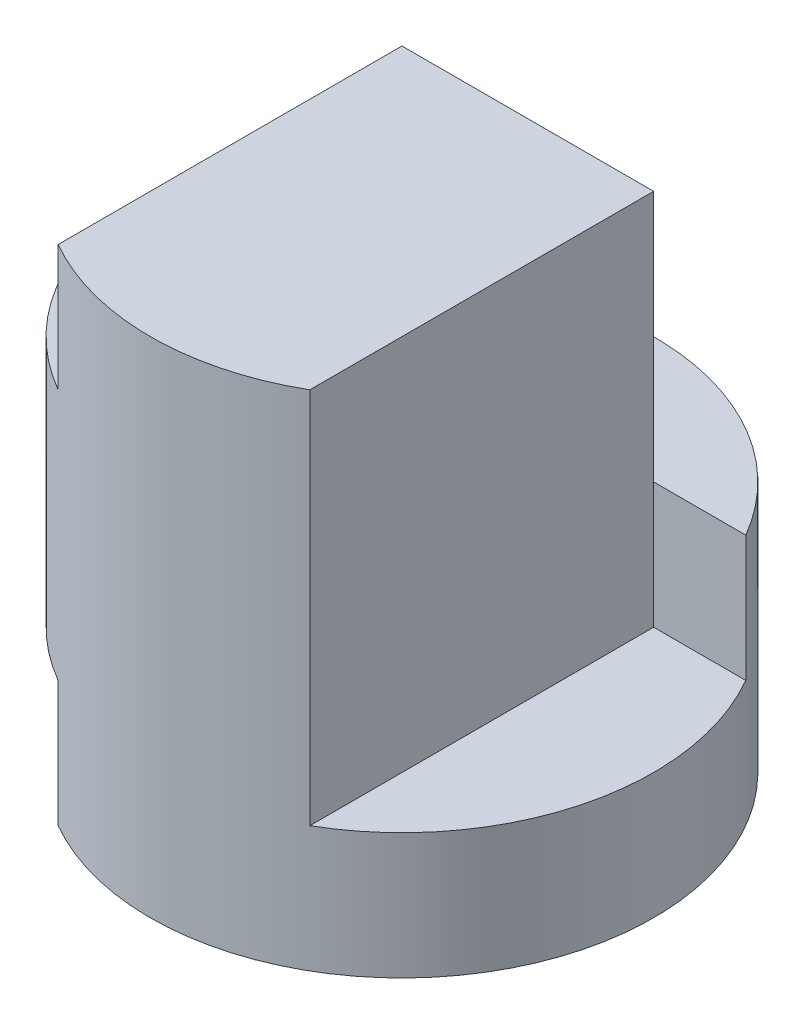
ISO-10303-21;
HEADER;
FILE_DESCRIPTION(('STEP AP214'),'2;1');
FILE_NAME('part.step','',(''),(''),'','','');
FILE_SCHEMA(('AUTOMOTIVE_DESIGN { 1 0 10303 214 1 1 1 1 }'));
ENDSEC;
DATA;
#1=APPLICATION_CONTEXT('core data for automotive mechanical design processes');
#2=APPLICATION_PROTOCOL_DEFINITION('international standard','automotive_design',2000,#1);
#3=PRODUCT_CONTEXT('',#1,'mechanical');
#4=PRODUCT('Part','Part','',(#3));
#5=PRODUCT_RELATED_PRODUCT_CATEGORY('part','',(#4));
#6=PRODUCT_DEFINITION_FORMATION('','',#4);
#7=PRODUCT_DEFINITION_CONTEXT('part definition',#1,'design');
#8=PRODUCT_DEFINITION('design','',#6,#7);
#9=PRODUCT_DEFINITION_SHAPE('','',#8);
#10=(LENGTH_UNIT() NAMED_UNIT(*) SI_UNIT(.MILLI.,.METRE.));
#11=(NAMED_UNIT(*) PLANE_ANGLE_UNIT() SI_UNIT($,.RADIAN.));
#12=(NAMED_UNIT(*) SI_UNIT($,.STERADIAN.) SOLID_ANGLE_UNIT());
#13=UNCERTAINTY_MEASURE_WITH_UNIT(LENGTH_MEASURE(1.E-05),#10,'distance_accuracy_value','');
#14=(GEOMETRIC_REPRESENTATION_CONTEXT(3) GLOBAL_UNCERTAINTY_ASSIGNED_CONTEXT((#13)) GLOBAL_UNIT_ASSIGNED_CONTEXT((#10,
#11,#12)) REPRESENTATION_CONTEXT('',''));
#15=CARTESIAN_POINT('',(0.,0.,0.));
#16=DIRECTION('',(0.,0.,1.));
#17=DIRECTION('',(1.,0.,0.));
#18=AXIS2_PLACEMENT_3D('',#15,#16,#17);
#19=CARTESIAN_POINT('',(0.,4.,0.));
#20=DIRECTION('',(0.,-1.,0.));
#21=DIRECTION('',(0.,0.,-1.));
#22=AXIS2_PLACEMENT_3D('',#19,#20,#21);
#23=CYLINDRICAL_SURFACE('',#22,2.);
#24=CARTESIAN_POINT('',(0.,3.,0.));
#25=DIRECTION('',(0.,1.,0.));
#26=DIRECTION('',(0.,0.,1.));
#27=AXIS2_PLACEMENT_3D('',#24,#25,#26);
#28=CIRCLE('',#27,2.);
#29=CARTESIAN_POINT('',(-1.73205080756888,3.,-1.));
#30=VERTEX_POINT('',#29);
#31=CARTESIAN_POINT('',(-1.,3.,1.73205080756888));
#32=VERTEX_POINT('',#31);
#33=EDGE_CURVE('E122',#30,#32,#28,.T.);
#34=ORIENTED_EDGE('',*,*,#33,.F.);
#35=DIRECTION('',(0.,1.,0.));
#36=VECTOR('',#35,1.);
#37=CARTESIAN_POINT('',(-1.73205080756888,2.,-1.));
#38=LINE('',#37,#36);
#39=CARTESIAN_POINT('',(-1.73205080756888,2.,-1.));
#40=VERTEX_POINT('',#39);
#41=EDGE_CURVE('E114',#40,#30,#38,.T.);
#42=ORIENTED_EDGE('',*,*,#41,.F.);
#43=CARTESIAN_POINT('',(0.,2.,0.));
#44=DIRECTION('',(0.,1.,0.));
#45=DIRECTION('',(0.,0.,-1.));
#46=AXIS2_PLACEMENT_3D('',#43,#44,#45);
#47=CIRCLE('',#46,2.);
#48=CARTESIAN_POINT('',(1.73205080756888,2.,-1.));
#49=VERTEX_POINT('',#48);
#50=EDGE_CURVE('E105',#49,#40,#47,.T.);
#51=ORIENTED_EDGE('',*,*,#50,.F.);
#52=DIRECTION('',(0.,-1.,0.));
#53=VECTOR('',#52,1.);
#54=CARTESIAN_POINT('',(1.73205080756888,4.,-1.));
#55=LINE('',#54,#53);
#56=CARTESIAN_POINT('',(1.73205080756888,1.,-1.));
#57=VERTEX_POINT('',#56);
#58=EDGE_CURVE('E154',#49,#57,#55,.T.);
#59=ORIENTED_EDGE('',*,*,#58,.T.);
#60=CARTESIAN_POINT('',(0.,1.,0.));
#61=DIRECTION('',(0.,1.,0.));
#62=DIRECTION('',(-1.,0.,0.));
#63=AXIS2_PLACEMENT_3D('',#60,#61,#62);
#64=CIRCLE('',#63,2.);
#65=CARTESIAN_POINT('',(1.,1.,1.73205080756888));
#66=VERTEX_POINT('',#65);
#67=EDGE_CURVE('E176',#66,#57,#64,.T.);
#68=ORIENTED_EDGE('',*,*,#67,.F.);
#69=DIRECTION('',(0.,-1.,0.));
#70=VECTOR('',#69,1.);
#71=CARTESIAN_POINT('',(1.,4.,1.73205080756888));
#72=LINE('',#71,#70);
#73=CARTESIAN_POINT('',(1.,4.,1.73205080756888));
#74=VERTEX_POINT('',#73);
#75=EDGE_CURVE('E156',#74,#66,#72,.T.);
#76=ORIENTED_EDGE('',*,*,#75,.F.);
#77=CARTESIAN_POINT('',(0.,4.,0.));
#78=DIRECTION('',(0.,1.,0.));
#79=DIRECTION('',(0.,0.,1.));
#80=AXIS2_PLACEMENT_3D('',#77,#78,#79);
#81=CIRCLE('',#80,2.);
#82=CARTESIAN_POINT('',(-1.,4.,1.73205080756888));
#83=VERTEX_POINT('',#82);
#84=EDGE_CURVE('E160',#83,#74,#81,.T.);
#85=ORIENTED_EDGE('',*,*,#84,.F.);
#86=DIRECTION('',(0.,-1.,0.));
#87=VECTOR('',#86,1.);
#88=CARTESIAN_POINT('',(-1.,4.,1.73205080756888));
#89=LINE('',#88,#87);
#90=EDGE_CURVE('E152',#32,#83,#89,.F.);
#91=ORIENTED_EDGE('',*,*,#90,.F.);
#92=EDGE_LOOP('',(#34,#42,#51,#59,#68,#76,#85,#91));
#93=FACE_BOUND('',#92,.T.);
#94=DIRECTION('',(0.,-1.,0.));
#95=VECTOR('',#94,1.);
#96=CARTESIAN_POINT('',(-1.,4.,1.73205080756888));
#97=LINE('',#96,#95);
#98=CARTESIAN_POINT('',(-1.,0.,1.73205080756888));
#99=VERTEX_POINT('',#98);
#100=CARTESIAN_POINT('',(-1.,1.,1.73205080756888));
#101=VERTEX_POINT('',#100);
#102=EDGE_CURVE('E149',#99,#101,#97,.F.);
#103=ORIENTED_EDGE('',*,*,#102,.F.);
#104=CARTESIAN_POINT('',(0.,0.,0.));
#105=DIRECTION('',(0.,1.,0.));
#106=DIRECTION('',(0.,0.,1.));
#107=AXIS2_PLACEMENT_3D('',#104,#105,#106);
#108=CIRCLE('',#107,2.);
#109=CARTESIAN_POINT('',(-1.73205080756888,0.,-1.));
#110=VERTEX_POINT('',#109);
#111=EDGE_CURVE('E159',#99,#110,#108,.T.);
#112=ORIENTED_EDGE('',*,*,#111,.T.);
#113=DIRECTION('',(0.,-1.,0.));
#114=VECTOR('',#113,1.);
#115=CARTESIAN_POINT('',(-1.73205080756888,4.,-1.));
#116=LINE('',#115,#114);
#117=CARTESIAN_POINT('',(-1.73205080756888,1.,-1.));
#118=VERTEX_POINT('',#117);
#119=EDGE_CURVE('E55',#110,#118,#116,.F.);
#120=ORIENTED_EDGE('',*,*,#119,.T.);
#121=CARTESIAN_POINT('',(0.,1.,0.));
#122=DIRECTION('',(0.,-1.,0.));
#123=DIRECTION('',(0.,0.,-1.));
#124=AXIS2_PLACEMENT_3D('',#121,#122,#123);
#125=CIRCLE('',#124,2.);
#126=EDGE_CURVE('E40',#101,#118,#125,.T.);
#127=ORIENTED_EDGE('',*,*,#126,.F.);
#128=EDGE_LOOP('',(#103,#112,#120,#127));
#129=FACE_BOUND('',#128,.T.);
#130=ADVANCED_FACE('F33',(#93,#129),#23,.T.);
#131=CARTESIAN_POINT('',(0.,4.,0.));
#132=DIRECTION('',(0.,1.,0.));
#133=DIRECTION('',(0.,0.,1.));
#134=AXIS2_PLACEMENT_3D('',#131,#132,#133);
#135=PLANE('',#134);
#136=DIRECTION('',(1.,0.,0.));
#137=VECTOR('',#136,1.);
#138=CARTESIAN_POINT('',(-1.73205080756888,4.,-1.));
#139=LINE('',#138,#137);
#140=CARTESIAN_POINT('',(-1.,4.,-1.));
#141=VERTEX_POINT('',#140);
#142=CARTESIAN_POINT('',(0.999999999999999,4.,-1.));
#143=VERTEX_POINT('',#142);
#144=EDGE_CURVE('E110',#141,#143,#139,.T.);
#145=ORIENTED_EDGE('',*,*,#144,.F.);
#146=DIRECTION('',(0.,0.,1.));
#147=VECTOR('',#146,1.);
#148=CARTESIAN_POINT('',(-1.,4.,0.));
#149=LINE('',#148,#147);
#150=EDGE_CURVE('E169',#141,#83,#149,.T.);
#151=ORIENTED_EDGE('',*,*,#150,.T.);
#152=ORIENTED_EDGE('',*,*,#84,.T.);
#153=DIRECTION('',(0.,0.,-1.));
#154=VECTOR('',#153,1.);
#155=CARTESIAN_POINT('',(1.,4.,0.));
#156=LINE('',#155,#154);
#157=EDGE_CURVE('E172',#74,#143,#156,.T.);
#158=ORIENTED_EDGE('',*,*,#157,.T.);
#159=EDGE_LOOP('',(#145,#151,#152,#158));
#160=FACE_BOUND('',#159,.T.);
#161=ADVANCED_FACE('F202',(#160),#135,.T.);
#162=CARTESIAN_POINT('',(0.,0.,0.));
#163=DIRECTION('',(0.,1.,0.));
#164=DIRECTION('',(0.,0.,1.));
#165=AXIS2_PLACEMENT_3D('',#162,#163,#164);
#166=PLANE('',#165);
#167=DIRECTION('',(0.,0.,1.));
#168=VECTOR('',#167,1.);
#169=CARTESIAN_POINT('',(-1.,0.,0.));
#170=LINE('',#169,#168);
#171=CARTESIAN_POINT('',(-1.,0.,-1.));
#172=VERTEX_POINT('',#171);
#173=EDGE_CURVE('E167',#172,#99,#170,.T.);
#174=ORIENTED_EDGE('',*,*,#173,.F.);
#175=DIRECTION('',(-1.,0.,0.));
#176=VECTOR('',#175,1.);
#177=CARTESIAN_POINT('',(0.,0.,-1.));
#178=LINE('',#177,#176);
#179=EDGE_CURVE('E163',#172,#110,#178,.T.);
#180=ORIENTED_EDGE('',*,*,#179,.T.);
#181=ORIENTED_EDGE('',*,*,#111,.F.);
#182=EDGE_LOOP('',(#174,#180,#181));
#183=FACE_BOUND('',#182,.T.);
#184=ADVANCED_FACE('F188',(#183),#166,.F.);
#185=CARTESIAN_POINT('',(-2.,1.,4.));
#186=DIRECTION('',(0.,-1.,0.));
#187=DIRECTION('',(0.,0.,-1.));
#188=AXIS2_PLACEMENT_3D('',#185,#186,#187);
#189=PLANE('',#188);
#190=DIRECTION('',(0.,0.,-1.));
#191=VECTOR('',#190,1.);
#192=CARTESIAN_POINT('',(-1.,1.,4.));
#193=LINE('',#192,#191);
#194=CARTESIAN_POINT('',(-1.,1.,-1.));
#195=VERTEX_POINT('',#194);
#196=EDGE_CURVE('E140',#101,#195,#193,.T.);
#197=ORIENTED_EDGE('',*,*,#196,.F.);
#198=ORIENTED_EDGE('',*,*,#126,.T.);
#199=DIRECTION('',(-1.,0.,0.));
#200=VECTOR('',#199,1.);
#201=CARTESIAN_POINT('',(-2.,1.,-1.));
#202=LINE('',#201,#200);
#203=EDGE_CURVE('E126',#195,#118,#202,.T.);
#204=ORIENTED_EDGE('',*,*,#203,.F.);
#205=EDGE_LOOP('',(#197,#198,#204));
#206=FACE_BOUND('',#205,.T.);
#207=ADVANCED_FACE('F181',(#206),#189,.T.);
#208=CARTESIAN_POINT('',(-1.,0.,4.));
#209=DIRECTION('',(-1.,0.,0.));
#210=DIRECTION('',(0.,0.,1.));
#211=AXIS2_PLACEMENT_3D('',#208,#209,#210);
#212=PLANE('',#211);
#213=ORIENTED_EDGE('',*,*,#102,.T.);
#214=ORIENTED_EDGE('',*,*,#196,.T.);
#215=DIRECTION('',(0.,1.,0.));
#216=VECTOR('',#215,1.);
#217=CARTESIAN_POINT('',(-1.,0.,-1.));
#218=LINE('',#217,#216);
#219=EDGE_CURVE('E123',#172,#195,#218,.T.);
#220=ORIENTED_EDGE('',*,*,#219,.F.);
#221=ORIENTED_EDGE('',*,*,#173,.T.);
#222=EDGE_LOOP('',(#213,#214,#220,#221));
#223=FACE_BOUND('',#222,.T.);
#224=ADVANCED_FACE('F190',(#223),#212,.T.);
#225=CARTESIAN_POINT('',(0.,0.,-1.));
#226=DIRECTION('',(0.,0.,-1.));
#227=DIRECTION('',(-1.,0.,0.));
#228=AXIS2_PLACEMENT_3D('',#225,#226,#227);
#229=PLANE('',#228);
#230=ORIENTED_EDGE('',*,*,#179,.F.);
#231=ORIENTED_EDGE('',*,*,#219,.T.);
#232=ORIENTED_EDGE('',*,*,#203,.T.);
#233=ORIENTED_EDGE('',*,*,#119,.F.);
#234=EDGE_LOOP('',(#230,#231,#232,#233));
#235=FACE_BOUND('',#234,.T.);
#236=ADVANCED_FACE('F183',(#235),#229,.F.);
#237=CARTESIAN_POINT('',(-2.,3.,4.));
#238=DIRECTION('',(0.,1.,0.));
#239=DIRECTION('',(0.,0.,1.));
#240=AXIS2_PLACEMENT_3D('',#237,#238,#239);
#241=PLANE('',#240);
#242=ORIENTED_EDGE('',*,*,#33,.T.);
#243=DIRECTION('',(0.,0.,-1.));
#244=VECTOR('',#243,1.);
#245=CARTESIAN_POINT('',(-1.,3.,4.));
#246=LINE('',#245,#244);
#247=CARTESIAN_POINT('',(-1.,3.,-1.));
#248=VERTEX_POINT('',#247);
#249=EDGE_CURVE('E145',#32,#248,#246,.T.);
#250=ORIENTED_EDGE('',*,*,#249,.T.);
#251=DIRECTION('',(1.,0.,0.));
#252=VECTOR('',#251,1.);
#253=CARTESIAN_POINT('',(-2.,3.,-1.));
#254=LINE('',#253,#252);
#255=EDGE_CURVE('E137',#30,#248,#254,.T.);
#256=ORIENTED_EDGE('',*,*,#255,.F.);
#257=EDGE_LOOP('',(#242,#250,#256));
#258=FACE_BOUND('',#257,.T.);
#259=ADVANCED_FACE('F197',(#258),#241,.T.);
#260=CARTESIAN_POINT('',(-1.,4.,4.));
#261=DIRECTION('',(-1.,0.,0.));
#262=DIRECTION('',(0.,-1.,0.));
#263=AXIS2_PLACEMENT_3D('',#260,#261,#262);
#264=PLANE('',#263);
#265=ORIENTED_EDGE('',*,*,#90,.T.);
#266=ORIENTED_EDGE('',*,*,#150,.F.);
#267=DIRECTION('',(0.,1.,0.));
#268=VECTOR('',#267,1.);
#269=CARTESIAN_POINT('',(-1.,4.,-1.));
#270=LINE('',#269,#268);
#271=EDGE_CURVE('E143',#248,#141,#270,.T.);
#272=ORIENTED_EDGE('',*,*,#271,.F.);
#273=ORIENTED_EDGE('',*,*,#249,.F.);
#274=EDGE_LOOP('',(#265,#266,#272,#273));
#275=FACE_BOUND('',#274,.T.);
#276=ADVANCED_FACE('F214',(#275),#264,.T.);
#277=CARTESIAN_POINT('',(2.,1.,4.));
#278=DIRECTION('',(0.,1.,0.));
#279=DIRECTION('',(-1.,0.,0.));
#280=AXIS2_PLACEMENT_3D('',#277,#278,#279);
#281=PLANE('',#280);
#282=DIRECTION('',(0.,0.,-1.));
#283=VECTOR('',#282,1.);
#284=CARTESIAN_POINT('',(1.,1.,4.));
#285=LINE('',#284,#283);
#286=CARTESIAN_POINT('',(1.,1.,-1.));
#287=VERTEX_POINT('',#286);
#288=EDGE_CURVE('E135',#66,#287,#285,.T.);
#289=ORIENTED_EDGE('',*,*,#288,.F.);
#290=ORIENTED_EDGE('',*,*,#67,.T.);
#291=DIRECTION('',(1.,0.,0.));
#292=VECTOR('',#291,1.);
#293=CARTESIAN_POINT('',(2.,1.,-1.));
#294=LINE('',#293,#292);
#295=EDGE_CURVE('E131',#287,#57,#294,.T.);
#296=ORIENTED_EDGE('',*,*,#295,.F.);
#297=EDGE_LOOP('',(#289,#290,#296));
#298=FACE_BOUND('',#297,.T.);
#299=ADVANCED_FACE('F217',(#298),#281,.T.);
#300=CARTESIAN_POINT('',(1.,4.,4.));
#301=DIRECTION('',(1.,0.,0.));
#302=DIRECTION('',(0.,1.,0.));
#303=AXIS2_PLACEMENT_3D('',#300,#301,#302);
#304=PLANE('',#303);
#305=ORIENTED_EDGE('',*,*,#75,.T.);
#306=ORIENTED_EDGE('',*,*,#288,.T.);
#307=DIRECTION('',(0.,-1.,0.));
#308=VECTOR('',#307,1.);
#309=CARTESIAN_POINT('',(1.,4.,-1.));
#310=LINE('',#309,#308);
#311=CARTESIAN_POINT('',(1.,2.,-1.));
#312=VERTEX_POINT('',#311);
#313=EDGE_CURVE('E132',#312,#287,#310,.T.);
#314=ORIENTED_EDGE('',*,*,#313,.F.);
#315=EDGE_CURVE('E117',#143,#312,#310,.T.);
#316=ORIENTED_EDGE('',*,*,#315,.F.);
#317=ORIENTED_EDGE('',*,*,#157,.F.);
#318=EDGE_LOOP('',(#305,#306,#314,#316,#317));
#319=FACE_BOUND('',#318,.T.);
#320=ADVANCED_FACE('F222',(#319),#304,.T.);
#321=CARTESIAN_POINT('',(0.,0.,-1.));
#322=DIRECTION('',(0.,0.,-1.));
#323=DIRECTION('',(-1.,0.,0.));
#324=AXIS2_PLACEMENT_3D('',#321,#322,#323);
#325=PLANE('',#324);
#326=ORIENTED_EDGE('',*,*,#58,.F.);
#327=DIRECTION('',(-1.,0.,0.));
#328=VECTOR('',#327,1.);
#329=CARTESIAN_POINT('',(0.,2.,-1.));
#330=LINE('',#329,#328);
#331=EDGE_CURVE('E11',#49,#312,#330,.T.);
#332=ORIENTED_EDGE('',*,*,#331,.T.);
#333=ORIENTED_EDGE('',*,*,#313,.T.);
#334=ORIENTED_EDGE('',*,*,#295,.T.);
#335=EDGE_LOOP('',(#326,#332,#333,#334));
#336=FACE_BOUND('',#335,.T.);
#337=ADVANCED_FACE('F235',(#336),#325,.F.);
#338=CARTESIAN_POINT('',(-1.73205080756888,2.,-1.));
#339=DIRECTION('',(0.,0.,1.));
#340=DIRECTION('',(1.,0.,0.));
#341=AXIS2_PLACEMENT_3D('',#338,#339,#340);
#342=PLANE('',#341);
#343=ORIENTED_EDGE('',*,*,#255,.T.);
#344=ORIENTED_EDGE('',*,*,#271,.T.);
#345=ORIENTED_EDGE('',*,*,#144,.T.);
#346=ORIENTED_EDGE('',*,*,#315,.T.);
#347=DIRECTION('',(1.,0.,0.));
#348=VECTOR('',#347,1.);
#349=CARTESIAN_POINT('',(-1.73205080756888,2.,-1.));
#350=LINE('',#349,#348);
#351=EDGE_CURVE('E47',#40,#312,#350,.T.);
#352=ORIENTED_EDGE('',*,*,#351,.F.);
#353=ORIENTED_EDGE('',*,*,#41,.T.);
#354=EDGE_LOOP('',(#343,#344,#345,#346,#352,#353));
#355=FACE_BOUND('',#354,.T.);
#356=ADVANCED_FACE('F113',(#355),#342,.F.);
#357=CARTESIAN_POINT('',(0.,2.,0.));
#358=DIRECTION('',(0.,-1.,0.));
#359=DIRECTION('',(0.,0.,-1.));
#360=AXIS2_PLACEMENT_3D('',#357,#358,#359);
#361=PLANE('',#360);
#362=ORIENTED_EDGE('',*,*,#50,.T.);
#363=ORIENTED_EDGE('',*,*,#351,.T.);
#364=ORIENTED_EDGE('',*,*,#331,.F.);
#365=EDGE_LOOP('',(#362,#363,#364));
#366=FACE_BOUND('',#365,.T.);
#367=ADVANCED_FACE('F106',(#366),#361,.F.);
#368=CLOSED_SHELL('',(#130,#161,#184,#207,#224,#236,#259,#276,#299,#320,#337,#356,#367));
#369=MANIFOLD_SOLID_BREP('B2',#368);
#370=ADVANCED_BREP_SHAPE_REPRESENTATION('',(#18,#369),#14);
#371=SHAPE_DEFINITION_REPRESENTATION(#9,#370);
ENDSEC;
END-ISO-10303-21;
